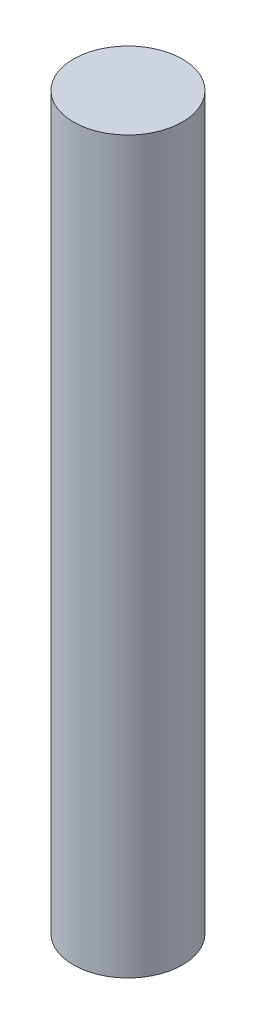
ISO-10303-21;
HEADER;
FILE_DESCRIPTION(('STEP AP214'),'2;1');
FILE_NAME('part.step','',(''),(''),'','','');
FILE_SCHEMA(('AUTOMOTIVE_DESIGN { 1 0 10303 214 1 1 1 1 }'));
ENDSEC;
DATA;
#1=APPLICATION_CONTEXT('core data for automotive mechanical design processes');
#2=APPLICATION_PROTOCOL_DEFINITION('international standard','automotive_design',2000,#1);
#3=PRODUCT_CONTEXT('',#1,'mechanical');
#4=PRODUCT('Part','Part','',(#3));
#5=PRODUCT_RELATED_PRODUCT_CATEGORY('part','',(#4));
#6=PRODUCT_DEFINITION_FORMATION('','',#4);
#7=PRODUCT_DEFINITION_CONTEXT('part definition',#1,'design');
#8=PRODUCT_DEFINITION('design','',#6,#7);
#9=PRODUCT_DEFINITION_SHAPE('','',#8);
#10=(LENGTH_UNIT() NAMED_UNIT(*) SI_UNIT(.MILLI.,.METRE.));
#11=(NAMED_UNIT(*) PLANE_ANGLE_UNIT() SI_UNIT($,.RADIAN.));
#12=(NAMED_UNIT(*) SI_UNIT($,.STERADIAN.) SOLID_ANGLE_UNIT());
#13=UNCERTAINTY_MEASURE_WITH_UNIT(LENGTH_MEASURE(1.E-05),#10,'distance_accuracy_value','');
#14=(GEOMETRIC_REPRESENTATION_CONTEXT(3) GLOBAL_UNCERTAINTY_ASSIGNED_CONTEXT((#13)) GLOBAL_UNIT_ASSIGNED_CONTEXT((#10,
#11,#12)) REPRESENTATION_CONTEXT('',''));
#15=CARTESIAN_POINT('',(0.,0.,0.));
#16=DIRECTION('',(0.,0.,1.));
#17=DIRECTION('',(1.,0.,0.));
#18=AXIS2_PLACEMENT_3D('',#15,#16,#17);
#19=CARTESIAN_POINT('',(0.,40.175,0.));
#20=DIRECTION('',(0.,-1.,0.));
#21=DIRECTION('',(0.,0.,-1.));
#22=AXIS2_PLACEMENT_3D('',#19,#20,#21);
#23=CYLINDRICAL_SURFACE('',#22,3.);
#24=CARTESIAN_POINT('',(0.,40.175,0.));
#25=DIRECTION('',(0.,1.,0.));
#26=DIRECTION('',(0.,0.,1.));
#27=AXIS2_PLACEMENT_3D('',#24,#25,#26);
#28=CIRCLE('',#27,3.);
#29=CARTESIAN_POINT('',(0.,40.175,3.));
#30=VERTEX_POINT('',#29);
#31=EDGE_CURVE('E10',#30,#30,#28,.T.);
#32=ORIENTED_EDGE('',*,*,#31,.F.);
#33=EDGE_LOOP('',(#32));
#34=FACE_BOUND('',#33,.T.);
#35=CARTESIAN_POINT('',(0.,0.,0.));
#36=DIRECTION('',(0.,1.,0.));
#37=DIRECTION('',(0.,0.,1.));
#38=AXIS2_PLACEMENT_3D('',#35,#36,#37);
#39=CIRCLE('',#38,3.);
#40=CARTESIAN_POINT('',(0.,0.,3.));
#41=VERTEX_POINT('',#40);
#42=EDGE_CURVE('E34',#41,#41,#39,.T.);
#43=ORIENTED_EDGE('',*,*,#42,.T.);
#44=EDGE_LOOP('',(#43));
#45=FACE_BOUND('',#44,.T.);
#46=ADVANCED_FACE('F31',(#34,#45),#23,.T.);
#47=CARTESIAN_POINT('',(0.,40.175,0.));
#48=DIRECTION('',(0.,1.,0.));
#49=DIRECTION('',(0.,0.,1.));
#50=AXIS2_PLACEMENT_3D('',#47,#48,#49);
#51=PLANE('',#50);
#52=ORIENTED_EDGE('',*,*,#31,.T.);
#53=EDGE_LOOP('',(#52));
#54=FACE_BOUND('',#53,.T.);
#55=ADVANCED_FACE('F46',(#54),#51,.T.);
#56=CARTESIAN_POINT('',(0.,0.,0.));
#57=DIRECTION('',(0.,1.,0.));
#58=DIRECTION('',(0.,0.,1.));
#59=AXIS2_PLACEMENT_3D('',#56,#57,#58);
#60=PLANE('',#59);
#61=ORIENTED_EDGE('',*,*,#42,.F.);
#62=EDGE_LOOP('',(#61));
#63=FACE_BOUND('',#62,.T.);
#64=ADVANCED_FACE('F44',(#63),#60,.F.);
#65=CLOSED_SHELL('',(#46,#55,#64));
#66=MANIFOLD_SOLID_BREP('B2',#65);
#67=ADVANCED_BREP_SHAPE_REPRESENTATION('',(#18,#66),#14);
#68=SHAPE_DEFINITION_REPRESENTATION(#9,#67);
ENDSEC;
END-ISO-10303-21;
